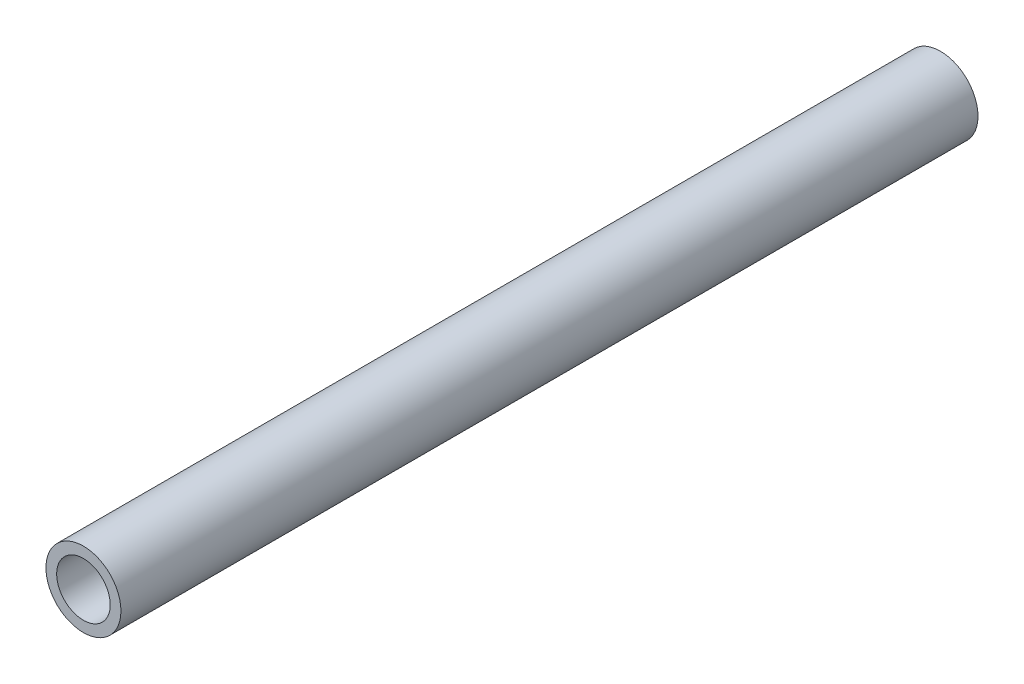
ISO-10303-21;
HEADER;
FILE_DESCRIPTION(('STEP AP214'),'2;1');
FILE_NAME('part.step','',(''),(''),'','','');
FILE_SCHEMA(('AUTOMOTIVE_DESIGN { 1 0 10303 214 1 1 1 1 }'));
ENDSEC;
DATA;
#1=APPLICATION_CONTEXT('core data for automotive mechanical design processes');
#2=APPLICATION_PROTOCOL_DEFINITION('international standard','automotive_design',2000,#1);
#3=PRODUCT_CONTEXT('',#1,'mechanical');
#4=PRODUCT('Part','Part','',(#3));
#5=PRODUCT_RELATED_PRODUCT_CATEGORY('part','',(#4));
#6=PRODUCT_DEFINITION_FORMATION('','',#4);
#7=PRODUCT_DEFINITION_CONTEXT('part definition',#1,'design');
#8=PRODUCT_DEFINITION('design','',#6,#7);
#9=PRODUCT_DEFINITION_SHAPE('','',#8);
#10=(LENGTH_UNIT() NAMED_UNIT(*) SI_UNIT(.MILLI.,.METRE.));
#11=(NAMED_UNIT(*) PLANE_ANGLE_UNIT() SI_UNIT($,.RADIAN.));
#12=(NAMED_UNIT(*) SI_UNIT($,.STERADIAN.) SOLID_ANGLE_UNIT());
#13=UNCERTAINTY_MEASURE_WITH_UNIT(LENGTH_MEASURE(1.E-05),#10,'distance_accuracy_value','');
#14=(GEOMETRIC_REPRESENTATION_CONTEXT(3) GLOBAL_UNCERTAINTY_ASSIGNED_CONTEXT((#13)) GLOBAL_UNIT_ASSIGNED_CONTEXT((#10,
#11,#12)) REPRESENTATION_CONTEXT('',''));
#15=CARTESIAN_POINT('',(0.,0.,0.));
#16=DIRECTION('',(0.,0.,1.));
#17=DIRECTION('',(1.,0.,0.));
#18=AXIS2_PLACEMENT_3D('',#15,#16,#17);
#19=CARTESIAN_POINT('',(0.,0.,304.8));
#20=DIRECTION('',(0.,0.,-1.));
#21=DIRECTION('',(-1.,0.,0.));
#22=AXIS2_PLACEMENT_3D('',#19,#20,#21);
#23=CYLINDRICAL_SURFACE('',#22,13.335);
#24=CARTESIAN_POINT('',(0.,0.,304.8));
#25=DIRECTION('',(0.,0.,1.));
#26=DIRECTION('',(1.,0.,0.));
#27=AXIS2_PLACEMENT_3D('',#24,#25,#26);
#28=CIRCLE('',#27,13.335);
#29=CARTESIAN_POINT('',(13.335,0.,304.8));
#30=VERTEX_POINT('',#29);
#31=EDGE_CURVE('E10',#30,#30,#28,.T.);
#32=ORIENTED_EDGE('',*,*,#31,.F.);
#33=EDGE_LOOP('',(#32));
#34=FACE_BOUND('',#33,.T.);
#35=CARTESIAN_POINT('',(0.,0.,0.));
#36=DIRECTION('',(0.,0.,1.));
#37=DIRECTION('',(1.,0.,0.));
#38=AXIS2_PLACEMENT_3D('',#35,#36,#37);
#39=CIRCLE('',#38,13.335);
#40=CARTESIAN_POINT('',(13.335,0.,0.));
#41=VERTEX_POINT('',#40);
#42=EDGE_CURVE('E34',#41,#41,#39,.T.);
#43=ORIENTED_EDGE('',*,*,#42,.T.);
#44=EDGE_LOOP('',(#43));
#45=FACE_BOUND('',#44,.T.);
#46=ADVANCED_FACE('F31',(#34,#45),#23,.T.);
#47=CARTESIAN_POINT('',(0.,0.,304.8));
#48=DIRECTION('',(0.,0.,1.));
#49=DIRECTION('',(1.,0.,0.));
#50=AXIS2_PLACEMENT_3D('',#47,#48,#49);
#51=PLANE('',#50);
#52=CARTESIAN_POINT('',(0.,0.,304.8));
#53=DIRECTION('',(0.,0.,-1.));
#54=DIRECTION('',(-1.,0.,0.));
#55=AXIS2_PLACEMENT_3D('',#52,#53,#54);
#56=CIRCLE('',#55,9.525);
#57=CARTESIAN_POINT('',(-9.525,0.,304.8));
#58=VERTEX_POINT('',#57);
#59=EDGE_CURVE('E41',#58,#58,#56,.T.);
#60=ORIENTED_EDGE('',*,*,#59,.T.);
#61=EDGE_LOOP('',(#60));
#62=FACE_BOUND('',#61,.T.);
#63=ORIENTED_EDGE('',*,*,#31,.T.);
#64=EDGE_LOOP('',(#63));
#65=FACE_BOUND('',#64,.T.);
#66=ADVANCED_FACE('F49',(#62,#65),#51,.T.);
#67=CARTESIAN_POINT('',(0.,0.,0.));
#68=DIRECTION('',(0.,0.,1.));
#69=DIRECTION('',(1.,0.,0.));
#70=AXIS2_PLACEMENT_3D('',#67,#68,#69);
#71=PLANE('',#70);
#72=CARTESIAN_POINT('',(0.,0.,0.));
#73=DIRECTION('',(0.,0.,-1.));
#74=DIRECTION('',(-1.,0.,0.));
#75=AXIS2_PLACEMENT_3D('',#72,#73,#74);
#76=CIRCLE('',#75,9.525);
#77=CARTESIAN_POINT('',(-9.525,0.,0.));
#78=VERTEX_POINT('',#77);
#79=EDGE_CURVE('E43',#78,#78,#76,.T.);
#80=ORIENTED_EDGE('',*,*,#79,.F.);
#81=EDGE_LOOP('',(#80));
#82=FACE_BOUND('',#81,.T.);
#83=ORIENTED_EDGE('',*,*,#42,.F.);
#84=EDGE_LOOP('',(#83));
#85=FACE_BOUND('',#84,.T.);
#86=ADVANCED_FACE('F54',(#82,#85),#71,.F.);
#87=CARTESIAN_POINT('',(0.,0.,304.8));
#88=DIRECTION('',(0.,0.,-1.));
#89=DIRECTION('',(-1.,0.,0.));
#90=AXIS2_PLACEMENT_3D('',#87,#88,#89);
#91=CYLINDRICAL_SURFACE('',#90,9.525);
#92=ORIENTED_EDGE('',*,*,#59,.F.);
#93=EDGE_LOOP('',(#92));
#94=FACE_BOUND('',#93,.T.);
#95=ORIENTED_EDGE('',*,*,#79,.T.);
#96=EDGE_LOOP('',(#95));
#97=FACE_BOUND('',#96,.T.);
#98=ADVANCED_FACE('F51',(#94,#97),#91,.F.);
#99=CLOSED_SHELL('',(#46,#66,#86,#98));
#100=MANIFOLD_SOLID_BREP('B2',#99);
#101=ADVANCED_BREP_SHAPE_REPRESENTATION('',(#18,#100),#14);
#102=SHAPE_DEFINITION_REPRESENTATION(#9,#101);
ENDSEC;
END-ISO-10303-21;
